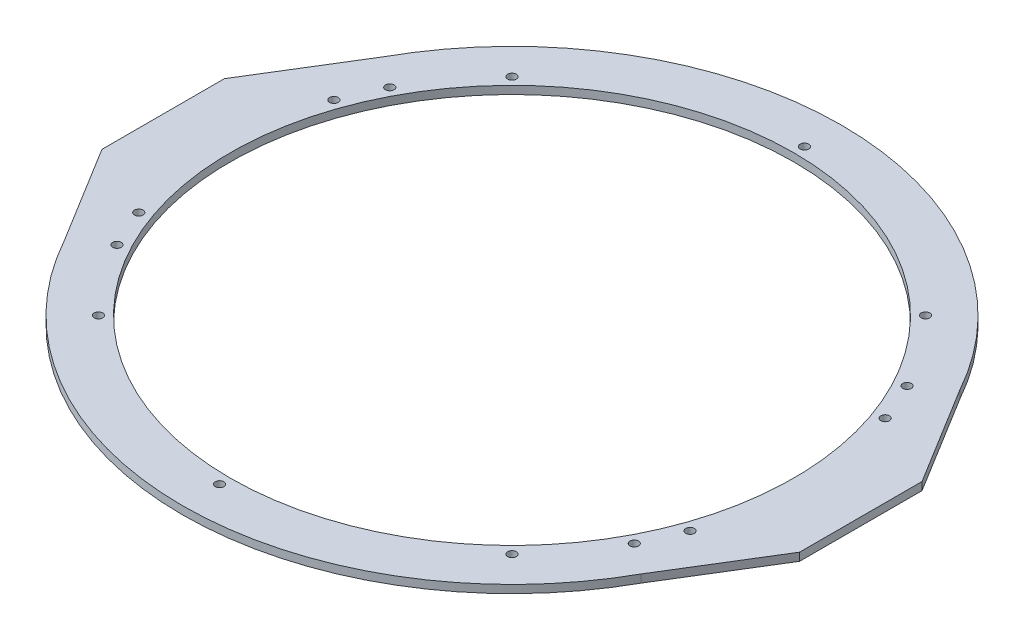
ISO-10303-21;
HEADER;
FILE_DESCRIPTION(('STEP AP214'),'2;1');
FILE_NAME('part.step','',(''),(''),'','','');
FILE_SCHEMA(('AUTOMOTIVE_DESIGN { 1 0 10303 214 1 1 1 1 }'));
ENDSEC;
DATA;
#1=APPLICATION_CONTEXT('core data for automotive mechanical design processes');
#2=APPLICATION_PROTOCOL_DEFINITION('international standard','automotive_design',2000,#1);
#3=PRODUCT_CONTEXT('',#1,'mechanical');
#4=PRODUCT('Part','Part','',(#3));
#5=PRODUCT_RELATED_PRODUCT_CATEGORY('part','',(#4));
#6=PRODUCT_DEFINITION_FORMATION('','',#4);
#7=PRODUCT_DEFINITION_CONTEXT('part definition',#1,'design');
#8=PRODUCT_DEFINITION('design','',#6,#7);
#9=PRODUCT_DEFINITION_SHAPE('','',#8);
#10=(LENGTH_UNIT() NAMED_UNIT(*) SI_UNIT(.MILLI.,.METRE.));
#11=(NAMED_UNIT(*) PLANE_ANGLE_UNIT() SI_UNIT($,.RADIAN.));
#12=(NAMED_UNIT(*) SI_UNIT($,.STERADIAN.) SOLID_ANGLE_UNIT());
#13=UNCERTAINTY_MEASURE_WITH_UNIT(LENGTH_MEASURE(1.E-05),#10,'distance_accuracy_value','');
#14=(GEOMETRIC_REPRESENTATION_CONTEXT(3) GLOBAL_UNCERTAINTY_ASSIGNED_CONTEXT((#13)) GLOBAL_UNIT_ASSIGNED_CONTEXT((#10,
#11,#12)) REPRESENTATION_CONTEXT('',''));
#15=CARTESIAN_POINT('',(0.,0.,0.));
#16=DIRECTION('',(0.,0.,1.));
#17=DIRECTION('',(1.,0.,0.));
#18=AXIS2_PLACEMENT_3D('',#15,#16,#17);
#19=CARTESIAN_POINT('',(0.,9.525,0.));
#20=DIRECTION('',(0.,1.,0.));
#21=DIRECTION('',(0.,0.,1.));
#22=AXIS2_PLACEMENT_3D('',#19,#20,#21);
#23=PLANE('',#22);
#24=DIRECTION('',(-0.523949451624135,0.,-0.851749359930941));
#25=VECTOR('',#24,1.);
#26=CARTESIAN_POINT('',(345.166052231368,9.52500000000001,-190.921970676538));
#27=LINE('',#26,#25);
#28=CARTESIAN_POINT('',(417.548677299358,9.52500000000001,-73.2544086995688));
#29=VERTEX_POINT('',#28);
#30=CARTESIAN_POINT('',(345.166052231368,9.52500000000001,-190.921970676538));
#31=VERTEX_POINT('',#30);
#32=EDGE_CURVE('E111',#29,#31,#27,.T.);
#33=ORIENTED_EDGE('',*,*,#32,.T.);
#34=CARTESIAN_POINT('',(0.,9.525,0.));
#35=DIRECTION('',(0.,1.,0.));
#36=DIRECTION('',(0.,0.,1.));
#37=AXIS2_PLACEMENT_3D('',#34,#35,#36);
#38=CIRCLE('',#37,394.45);
#39=CARTESIAN_POINT('',(-345.166052231368,9.52500000000001,-190.921970676538));
#40=VERTEX_POINT('',#39);
#41=EDGE_CURVE('E53',#31,#40,#38,.T.);
#42=ORIENTED_EDGE('',*,*,#41,.T.);
#43=DIRECTION('',(0.523949451624135,0.,-0.851749359930941));
#44=VECTOR('',#43,1.);
#45=CARTESIAN_POINT('',(-345.166052231368,9.52500000000001,-190.921970676538));
#46=LINE('',#45,#44);
#47=CARTESIAN_POINT('',(-417.548677299358,9.52500000000001,-73.2544086995688));
#48=VERTEX_POINT('',#47);
#49=EDGE_CURVE('E426',#48,#40,#46,.T.);
#50=ORIENTED_EDGE('',*,*,#49,.F.);
#51=DIRECTION('',(0.,0.,-1.));
#52=VECTOR('',#51,1.);
#53=CARTESIAN_POINT('',(-417.548677299358,9.52500000000001,-190.921970676538));
#54=LINE('',#53,#52);
#55=CARTESIAN_POINT('',(-417.548677299358,9.52500000000001,73.2544086995688));
#56=VERTEX_POINT('',#55);
#57=EDGE_CURVE('E414',#56,#48,#54,.T.);
#58=ORIENTED_EDGE('',*,*,#57,.F.);
#59=DIRECTION('',(0.523949451624135,0.,0.851749359930941));
#60=VECTOR('',#59,1.);
#61=CARTESIAN_POINT('',(-345.166052231368,9.52500000000001,190.921970676538));
#62=LINE('',#61,#60);
#63=CARTESIAN_POINT('',(-345.166052231368,9.52500000000001,190.921970676538));
#64=VERTEX_POINT('',#63);
#65=EDGE_CURVE('E412',#56,#64,#62,.T.);
#66=ORIENTED_EDGE('',*,*,#65,.T.);
#67=CARTESIAN_POINT('',(345.166052231368,9.52500000000001,190.921970676538));
#68=VERTEX_POINT('',#67);
#69=EDGE_CURVE('E13',#64,#68,#38,.T.);
#70=ORIENTED_EDGE('',*,*,#69,.T.);
#71=DIRECTION('',(-0.523949451624135,0.,0.851749359930941));
#72=VECTOR('',#71,1.);
#73=CARTESIAN_POINT('',(345.166052231368,9.52500000000001,190.921970676538));
#74=LINE('',#73,#72);
#75=CARTESIAN_POINT('',(417.548677299358,9.52500000000001,73.2544086995688));
#76=VERTEX_POINT('',#75);
#77=EDGE_CURVE('E134',#76,#68,#74,.T.);
#78=ORIENTED_EDGE('',*,*,#77,.F.);
#79=DIRECTION('',(0.,0.,-1.));
#80=VECTOR('',#79,1.);
#81=CARTESIAN_POINT('',(417.548677299358,9.52500000000001,-190.921970676538));
#82=LINE('',#81,#80);
#83=EDGE_CURVE('E128',#76,#29,#82,.T.);
#84=ORIENTED_EDGE('',*,*,#83,.T.);
#85=EDGE_LOOP('',(#33,#42,#50,#58,#66,#70,#78,#84));
#86=FACE_BOUND('',#85,.T.);
#87=CARTESIAN_POINT('',(0.,9.525,350.));
#88=DIRECTION('',(0.,1.,0.));
#89=DIRECTION('',(0.,0.,1.));
#90=AXIS2_PLACEMENT_3D('',#87,#88,#89);
#91=CIRCLE('',#90,5.15873999999999);
#92=CARTESIAN_POINT('',(0.,9.525,355.15874));
#93=VERTEX_POINT('',#92);
#94=EDGE_CURVE('E432',#93,#93,#91,.T.);
#95=ORIENTED_EDGE('',*,*,#94,.F.);
#96=EDGE_LOOP('',(#95));
#97=FACE_BOUND('',#96,.T.);
#98=CARTESIAN_POINT('',(-247.487373415292,9.525,247.487373415291));
#99=DIRECTION('',(0.,1.,0.));
#100=DIRECTION('',(0.,0.,1.));
#101=AXIS2_PLACEMENT_3D('',#98,#99,#100);
#102=CIRCLE('',#101,5.15873999999999);
#103=CARTESIAN_POINT('',(-247.487373415292,9.525,252.646113415291));
#104=VERTEX_POINT('',#103);
#105=EDGE_CURVE('E438',#104,#104,#102,.T.);
#106=ORIENTED_EDGE('',*,*,#105,.F.);
#107=EDGE_LOOP('',(#106));
#108=FACE_BOUND('',#107,.T.);
#109=CARTESIAN_POINT('',(-247.487373415289,9.525,-247.487373415295));
#110=DIRECTION('',(0.,1.,0.));
#111=DIRECTION('',(0.,0.,1.));
#112=AXIS2_PLACEMENT_3D('',#109,#110,#111);
#113=CIRCLE('',#112,5.15873999999999);
#114=CARTESIAN_POINT('',(-247.487373415289,9.525,-242.328633415295));
#115=VERTEX_POINT('',#114);
#116=EDGE_CURVE('E444',#115,#115,#113,.T.);
#117=ORIENTED_EDGE('',*,*,#116,.F.);
#118=EDGE_LOOP('',(#117));
#119=FACE_BOUND('',#118,.T.);
#120=CARTESIAN_POINT('',(2.41473507855972E-12,9.525,-350.));
#121=DIRECTION('',(0.,1.,0.));
#122=DIRECTION('',(0.,0.,1.));
#123=AXIS2_PLACEMENT_3D('',#120,#121,#122);
#124=CIRCLE('',#123,5.15873999999999);
#125=CARTESIAN_POINT('',(2.41473507855972E-12,9.525,-344.84126));
#126=VERTEX_POINT('',#125);
#127=EDGE_CURVE('E450',#126,#126,#124,.T.);
#128=ORIENTED_EDGE('',*,*,#127,.F.);
#129=EDGE_LOOP('',(#128));
#130=FACE_BOUND('',#129,.T.);
#131=CARTESIAN_POINT('',(247.487373415294,9.525,-247.48737341529));
#132=DIRECTION('',(0.,1.,0.));
#133=DIRECTION('',(0.,0.,1.));
#134=AXIS2_PLACEMENT_3D('',#131,#132,#133);
#135=CIRCLE('',#134,5.15873999999997);
#136=CARTESIAN_POINT('',(247.487373415294,9.525,-242.32863341529));
#137=VERTEX_POINT('',#136);
#138=EDGE_CURVE('E456',#137,#137,#135,.T.);
#139=ORIENTED_EDGE('',*,*,#138,.F.);
#140=EDGE_LOOP('',(#139));
#141=FACE_BOUND('',#140,.T.);
#142=CARTESIAN_POINT('',(247.487373415289,9.525,247.487373415295));
#143=DIRECTION('',(0.,1.,0.));
#144=DIRECTION('',(0.,0.,1.));
#145=AXIS2_PLACEMENT_3D('',#142,#143,#144);
#146=CIRCLE('',#145,5.15873999999999);
#147=CARTESIAN_POINT('',(247.487373415289,9.525,252.646113415295));
#148=VERTEX_POINT('',#147);
#149=EDGE_CURVE('E462',#148,#148,#146,.T.);
#150=ORIENTED_EDGE('',*,*,#149,.F.);
#151=EDGE_LOOP('',(#150));
#152=FACE_BOUND('',#151,.T.);
#153=CARTESIAN_POINT('',(329.955744274157,9.525,-116.744193947652));
#154=DIRECTION('',(0.,1.,0.));
#155=DIRECTION('',(0.,0.,1.));
#156=AXIS2_PLACEMENT_3D('',#153,#154,#155);
#157=CIRCLE('',#156,5.15873999999999);
#158=CARTESIAN_POINT('',(329.955744274157,9.525,-111.585453947652));
#159=VERTEX_POINT('',#158);
#160=EDGE_CURVE('E468',#159,#159,#157,.T.);
#161=ORIENTED_EDGE('',*,*,#160,.F.);
#162=EDGE_LOOP('',(#161));
#163=FACE_BOUND('',#162,.T.);
#164=CARTESIAN_POINT('',(309.580339669964,9.525,-163.278943191796));
#165=DIRECTION('',(0.,1.,0.));
#166=DIRECTION('',(0.,0.,1.));
#167=AXIS2_PLACEMENT_3D('',#164,#165,#166);
#168=CIRCLE('',#167,5.15873999999999);
#169=CARTESIAN_POINT('',(309.580339669964,9.525,-158.120203191796));
#170=VERTEX_POINT('',#169);
#171=EDGE_CURVE('E474',#170,#170,#168,.T.);
#172=ORIENTED_EDGE('',*,*,#171,.F.);
#173=EDGE_LOOP('',(#172));
#174=FACE_BOUND('',#173,.T.);
#175=CARTESIAN_POINT('',(-329.955744274157,9.525,-116.744193947652));
#176=DIRECTION('',(0.,1.,0.));
#177=DIRECTION('',(0.,0.,1.));
#178=AXIS2_PLACEMENT_3D('',#175,#176,#177);
#179=CIRCLE('',#178,5.15873999999999);
#180=CARTESIAN_POINT('',(-329.955744274157,9.525,-111.585453947652));
#181=VERTEX_POINT('',#180);
#182=EDGE_CURVE('E480',#181,#181,#179,.T.);
#183=ORIENTED_EDGE('',*,*,#182,.F.);
#184=EDGE_LOOP('',(#183));
#185=FACE_BOUND('',#184,.T.);
#186=CARTESIAN_POINT('',(-309.580339669964,9.525,-163.278943191796));
#187=DIRECTION('',(0.,1.,0.));
#188=DIRECTION('',(0.,0.,1.));
#189=AXIS2_PLACEMENT_3D('',#186,#187,#188);
#190=CIRCLE('',#189,5.15873999999999);
#191=CARTESIAN_POINT('',(-309.580339669964,9.525,-158.120203191796));
#192=VERTEX_POINT('',#191);
#193=EDGE_CURVE('E486',#192,#192,#190,.T.);
#194=ORIENTED_EDGE('',*,*,#193,.F.);
#195=EDGE_LOOP('',(#194));
#196=FACE_BOUND('',#195,.T.);
#197=CARTESIAN_POINT('',(-329.955744274157,9.525,116.744193947652));
#198=DIRECTION('',(0.,1.,0.));
#199=DIRECTION('',(0.,0.,1.));
#200=AXIS2_PLACEMENT_3D('',#197,#198,#199);
#201=CIRCLE('',#200,5.15873999999999);
#202=CARTESIAN_POINT('',(-329.955744274157,9.525,121.902933947652));
#203=VERTEX_POINT('',#202);
#204=EDGE_CURVE('E492',#203,#203,#201,.T.);
#205=ORIENTED_EDGE('',*,*,#204,.F.);
#206=EDGE_LOOP('',(#205));
#207=FACE_BOUND('',#206,.T.);
#208=CARTESIAN_POINT('',(-309.580339669964,9.525,163.278943191796));
#209=DIRECTION('',(0.,1.,0.));
#210=DIRECTION('',(0.,0.,1.));
#211=AXIS2_PLACEMENT_3D('',#208,#209,#210);
#212=CIRCLE('',#211,5.15873999999999);
#213=CARTESIAN_POINT('',(-309.580339669964,9.525,168.437683191796));
#214=VERTEX_POINT('',#213);
#215=EDGE_CURVE('E498',#214,#214,#212,.T.);
#216=ORIENTED_EDGE('',*,*,#215,.F.);
#217=EDGE_LOOP('',(#216));
#218=FACE_BOUND('',#217,.T.);
#219=CARTESIAN_POINT('',(329.955744274157,9.525,116.744193947652));
#220=DIRECTION('',(0.,1.,0.));
#221=DIRECTION('',(0.,0.,1.));
#222=AXIS2_PLACEMENT_3D('',#219,#220,#221);
#223=CIRCLE('',#222,5.15873999999999);
#224=CARTESIAN_POINT('',(329.955744274157,9.525,121.902933947652));
#225=VERTEX_POINT('',#224);
#226=EDGE_CURVE('E504',#225,#225,#223,.T.);
#227=ORIENTED_EDGE('',*,*,#226,.F.);
#228=EDGE_LOOP('',(#227));
#229=FACE_BOUND('',#228,.T.);
#230=CARTESIAN_POINT('',(309.580339669964,9.525,163.278943191796));
#231=DIRECTION('',(0.,1.,0.));
#232=DIRECTION('',(0.,0.,1.));
#233=AXIS2_PLACEMENT_3D('',#230,#231,#232);
#234=CIRCLE('',#233,5.15873999999999);
#235=CARTESIAN_POINT('',(309.580339669964,9.525,168.437683191796));
#236=VERTEX_POINT('',#235);
#237=EDGE_CURVE('E510',#236,#236,#234,.T.);
#238=ORIENTED_EDGE('',*,*,#237,.F.);
#239=EDGE_LOOP('',(#238));
#240=FACE_BOUND('',#239,.T.);
#241=CARTESIAN_POINT('',(0.,9.525,0.));
#242=DIRECTION('',(0.,1.,0.));
#243=DIRECTION('',(0.,0.,1.));
#244=AXIS2_PLACEMENT_3D('',#241,#242,#243);
#245=CIRCLE('',#244,337.3);
#246=CARTESIAN_POINT('',(0.,9.525,337.3));
#247=VERTEX_POINT('',#246);
#248=EDGE_CURVE('E144',#247,#247,#245,.T.);
#249=ORIENTED_EDGE('',*,*,#248,.F.);
#250=EDGE_LOOP('',(#249));
#251=FACE_BOUND('',#250,.T.);
#252=ADVANCED_FACE('F44',(#86,#97,#108,#119,#130,#141,#152,#163,#174,#185,#196,#207,#218,#229,
#240,#251),#23,.T.);
#253=CARTESIAN_POINT('',(0.,0.,0.));
#254=DIRECTION('',(0.,1.,0.));
#255=DIRECTION('',(0.,0.,1.));
#256=AXIS2_PLACEMENT_3D('',#253,#254,#255);
#257=PLANE('',#256);
#258=CARTESIAN_POINT('',(0.,0.,350.));
#259=DIRECTION('',(0.,1.,0.));
#260=DIRECTION('',(0.,0.,1.));
#261=AXIS2_PLACEMENT_3D('',#258,#259,#260);
#262=CIRCLE('',#261,5.15874);
#263=CARTESIAN_POINT('',(0.,0.,355.15874));
#264=VERTEX_POINT('',#263);
#265=EDGE_CURVE('E435',#264,#264,#262,.T.);
#266=ORIENTED_EDGE('',*,*,#265,.T.);
#267=EDGE_LOOP('',(#266));
#268=FACE_BOUND('',#267,.T.);
#269=CARTESIAN_POINT('',(-247.487373415292,0.,247.487373415291));
#270=DIRECTION('',(0.,1.,0.));
#271=DIRECTION('',(0.,0.,1.));
#272=AXIS2_PLACEMENT_3D('',#269,#270,#271);
#273=CIRCLE('',#272,5.15873999999999);
#274=CARTESIAN_POINT('',(-247.487373415292,0.,252.646113415291));
#275=VERTEX_POINT('',#274);
#276=EDGE_CURVE('E441',#275,#275,#273,.T.);
#277=ORIENTED_EDGE('',*,*,#276,.T.);
#278=EDGE_LOOP('',(#277));
#279=FACE_BOUND('',#278,.T.);
#280=CARTESIAN_POINT('',(-247.487373415289,0.,-247.487373415295));
#281=DIRECTION('',(0.,1.,0.));
#282=DIRECTION('',(0.,0.,1.));
#283=AXIS2_PLACEMENT_3D('',#280,#281,#282);
#284=CIRCLE('',#283,5.15873999999999);
#285=CARTESIAN_POINT('',(-247.487373415289,0.,-242.328633415295));
#286=VERTEX_POINT('',#285);
#287=EDGE_CURVE('E447',#286,#286,#284,.T.);
#288=ORIENTED_EDGE('',*,*,#287,.T.);
#289=EDGE_LOOP('',(#288));
#290=FACE_BOUND('',#289,.T.);
#291=CARTESIAN_POINT('',(2.41473507855972E-12,0.,-350.));
#292=DIRECTION('',(0.,1.,0.));
#293=DIRECTION('',(0.,0.,1.));
#294=AXIS2_PLACEMENT_3D('',#291,#292,#293);
#295=CIRCLE('',#294,5.15874);
#296=CARTESIAN_POINT('',(2.41473507855972E-12,0.,-344.84126));
#297=VERTEX_POINT('',#296);
#298=EDGE_CURVE('E453',#297,#297,#295,.T.);
#299=ORIENTED_EDGE('',*,*,#298,.T.);
#300=EDGE_LOOP('',(#299));
#301=FACE_BOUND('',#300,.T.);
#302=CARTESIAN_POINT('',(247.487373415294,0.,-247.48737341529));
#303=DIRECTION('',(0.,1.,0.));
#304=DIRECTION('',(0.,0.,1.));
#305=AXIS2_PLACEMENT_3D('',#302,#303,#304);
#306=CIRCLE('',#305,5.15874000000002);
#307=CARTESIAN_POINT('',(247.487373415294,0.,-242.328633415289));
#308=VERTEX_POINT('',#307);
#309=EDGE_CURVE('E459',#308,#308,#306,.T.);
#310=ORIENTED_EDGE('',*,*,#309,.T.);
#311=EDGE_LOOP('',(#310));
#312=FACE_BOUND('',#311,.T.);
#313=CARTESIAN_POINT('',(247.487373415289,0.,247.487373415295));
#314=DIRECTION('',(0.,1.,0.));
#315=DIRECTION('',(0.,0.,1.));
#316=AXIS2_PLACEMENT_3D('',#313,#314,#315);
#317=CIRCLE('',#316,5.15873999999999);
#318=CARTESIAN_POINT('',(247.487373415289,0.,252.646113415295));
#319=VERTEX_POINT('',#318);
#320=EDGE_CURVE('E465',#319,#319,#317,.T.);
#321=ORIENTED_EDGE('',*,*,#320,.T.);
#322=EDGE_LOOP('',(#321));
#323=FACE_BOUND('',#322,.T.);
#324=CARTESIAN_POINT('',(329.955744274157,0.,-116.744193947652));
#325=DIRECTION('',(0.,1.,0.));
#326=DIRECTION('',(0.,0.,1.));
#327=AXIS2_PLACEMENT_3D('',#324,#325,#326);
#328=CIRCLE('',#327,5.15873999999999);
#329=CARTESIAN_POINT('',(329.955744274157,0.,-111.585453947652));
#330=VERTEX_POINT('',#329);
#331=EDGE_CURVE('E471',#330,#330,#328,.T.);
#332=ORIENTED_EDGE('',*,*,#331,.T.);
#333=EDGE_LOOP('',(#332));
#334=FACE_BOUND('',#333,.T.);
#335=CARTESIAN_POINT('',(309.580339669964,0.,-163.278943191796));
#336=DIRECTION('',(0.,1.,0.));
#337=DIRECTION('',(0.,0.,1.));
#338=AXIS2_PLACEMENT_3D('',#335,#336,#337);
#339=CIRCLE('',#338,5.15873999999999);
#340=CARTESIAN_POINT('',(309.580339669964,0.,-158.120203191796));
#341=VERTEX_POINT('',#340);
#342=EDGE_CURVE('E477',#341,#341,#339,.T.);
#343=ORIENTED_EDGE('',*,*,#342,.T.);
#344=EDGE_LOOP('',(#343));
#345=FACE_BOUND('',#344,.T.);
#346=CARTESIAN_POINT('',(-329.955744274157,0.,-116.744193947652));
#347=DIRECTION('',(0.,1.,0.));
#348=DIRECTION('',(0.,0.,1.));
#349=AXIS2_PLACEMENT_3D('',#346,#347,#348);
#350=CIRCLE('',#349,5.15873999999999);
#351=CARTESIAN_POINT('',(-329.955744274157,0.,-111.585453947652));
#352=VERTEX_POINT('',#351);
#353=EDGE_CURVE('E483',#352,#352,#350,.T.);
#354=ORIENTED_EDGE('',*,*,#353,.T.);
#355=EDGE_LOOP('',(#354));
#356=FACE_BOUND('',#355,.T.);
#357=CARTESIAN_POINT('',(-309.580339669964,0.,-163.278943191796));
#358=DIRECTION('',(0.,1.,0.));
#359=DIRECTION('',(0.,0.,1.));
#360=AXIS2_PLACEMENT_3D('',#357,#358,#359);
#361=CIRCLE('',#360,5.15873999999999);
#362=CARTESIAN_POINT('',(-309.580339669964,0.,-158.120203191796));
#363=VERTEX_POINT('',#362);
#364=EDGE_CURVE('E489',#363,#363,#361,.T.);
#365=ORIENTED_EDGE('',*,*,#364,.T.);
#366=EDGE_LOOP('',(#365));
#367=FACE_BOUND('',#366,.T.);
#368=CARTESIAN_POINT('',(-329.955744274157,0.,116.744193947652));
#369=DIRECTION('',(0.,1.,0.));
#370=DIRECTION('',(0.,0.,1.));
#371=AXIS2_PLACEMENT_3D('',#368,#369,#370);
#372=CIRCLE('',#371,5.15873999999999);
#373=CARTESIAN_POINT('',(-329.955744274157,0.,121.902933947652));
#374=VERTEX_POINT('',#373);
#375=EDGE_CURVE('E495',#374,#374,#372,.T.);
#376=ORIENTED_EDGE('',*,*,#375,.T.);
#377=EDGE_LOOP('',(#376));
#378=FACE_BOUND('',#377,.T.);
#379=CARTESIAN_POINT('',(-309.580339669964,0.,163.278943191796));
#380=DIRECTION('',(0.,1.,0.));
#381=DIRECTION('',(0.,0.,1.));
#382=AXIS2_PLACEMENT_3D('',#379,#380,#381);
#383=CIRCLE('',#382,5.15873999999999);
#384=CARTESIAN_POINT('',(-309.580339669964,0.,168.437683191796));
#385=VERTEX_POINT('',#384);
#386=EDGE_CURVE('E501',#385,#385,#383,.T.);
#387=ORIENTED_EDGE('',*,*,#386,.T.);
#388=EDGE_LOOP('',(#387));
#389=FACE_BOUND('',#388,.T.);
#390=CARTESIAN_POINT('',(329.955744274157,0.,116.744193947652));
#391=DIRECTION('',(0.,1.,0.));
#392=DIRECTION('',(0.,0.,1.));
#393=AXIS2_PLACEMENT_3D('',#390,#391,#392);
#394=CIRCLE('',#393,5.15873999999999);
#395=CARTESIAN_POINT('',(329.955744274157,0.,121.902933947652));
#396=VERTEX_POINT('',#395);
#397=EDGE_CURVE('E507',#396,#396,#394,.T.);
#398=ORIENTED_EDGE('',*,*,#397,.T.);
#399=EDGE_LOOP('',(#398));
#400=FACE_BOUND('',#399,.T.);
#401=CARTESIAN_POINT('',(309.580339669964,0.,163.278943191796));
#402=DIRECTION('',(0.,1.,0.));
#403=DIRECTION('',(0.,0.,1.));
#404=AXIS2_PLACEMENT_3D('',#401,#402,#403);
#405=CIRCLE('',#404,5.15873999999999);
#406=CARTESIAN_POINT('',(309.580339669964,0.,168.437683191796));
#407=VERTEX_POINT('',#406);
#408=EDGE_CURVE('E513',#407,#407,#405,.T.);
#409=ORIENTED_EDGE('',*,*,#408,.T.);
#410=EDGE_LOOP('',(#409));
#411=FACE_BOUND('',#410,.T.);
#412=CARTESIAN_POINT('',(0.,0.,0.));
#413=DIRECTION('',(0.,1.,0.));
#414=DIRECTION('',(0.,0.,1.));
#415=AXIS2_PLACEMENT_3D('',#412,#413,#414);
#416=CIRCLE('',#415,337.3);
#417=CARTESIAN_POINT('',(0.,0.,337.3));
#418=VERTEX_POINT('',#417);
#419=EDGE_CURVE('E143',#418,#418,#416,.T.);
#420=ORIENTED_EDGE('',*,*,#419,.T.);
#421=EDGE_LOOP('',(#420));
#422=FACE_BOUND('',#421,.T.);
#423=CARTESIAN_POINT('',(0.,0.,0.));
#424=DIRECTION('',(0.,1.,0.));
#425=DIRECTION('',(0.,0.,1.));
#426=AXIS2_PLACEMENT_3D('',#423,#424,#425);
#427=CIRCLE('',#426,394.45);
#428=CARTESIAN_POINT('',(345.166052231368,0.,-190.921970676538));
#429=VERTEX_POINT('',#428);
#430=CARTESIAN_POINT('',(-345.166052231368,0.,-190.921970676538));
#431=VERTEX_POINT('',#430);
#432=EDGE_CURVE('E147',#429,#431,#427,.T.);
#433=ORIENTED_EDGE('',*,*,#432,.F.);
#434=DIRECTION('',(-0.523949451624135,0.,-0.851749359930941));
#435=VECTOR('',#434,1.);
#436=CARTESIAN_POINT('',(345.166052231368,0.,-190.921970676538));
#437=LINE('',#436,#435);
#438=CARTESIAN_POINT('',(417.548677299358,0.,-73.2544086995688));
#439=VERTEX_POINT('',#438);
#440=EDGE_CURVE('E122',#439,#429,#437,.T.);
#441=ORIENTED_EDGE('',*,*,#440,.F.);
#442=DIRECTION('',(0.,0.,-1.));
#443=VECTOR('',#442,1.);
#444=CARTESIAN_POINT('',(417.548677299358,0.,-190.921970676538));
#445=LINE('',#444,#443);
#446=CARTESIAN_POINT('',(417.548677299358,0.,73.2544086995688));
#447=VERTEX_POINT('',#446);
#448=EDGE_CURVE('E130',#447,#439,#445,.T.);
#449=ORIENTED_EDGE('',*,*,#448,.F.);
#450=DIRECTION('',(-0.523949451624135,0.,0.851749359930941));
#451=VECTOR('',#450,1.);
#452=CARTESIAN_POINT('',(345.166052231368,0.,190.921970676538));
#453=LINE('',#452,#451);
#454=CARTESIAN_POINT('',(345.166052231368,0.,190.921970676538));
#455=VERTEX_POINT('',#454);
#456=EDGE_CURVE('E60',#447,#455,#453,.T.);
#457=ORIENTED_EDGE('',*,*,#456,.T.);
#458=CARTESIAN_POINT('',(-345.166052231368,0.,190.921970676538));
#459=VERTEX_POINT('',#458);
#460=EDGE_CURVE('E48',#459,#455,#427,.T.);
#461=ORIENTED_EDGE('',*,*,#460,.F.);
#462=DIRECTION('',(0.523949451624135,0.,0.851749359930941));
#463=VECTOR('',#462,1.);
#464=CARTESIAN_POINT('',(-345.166052231368,0.,190.921970676538));
#465=LINE('',#464,#463);
#466=CARTESIAN_POINT('',(-417.548677299358,0.,73.2544086995688));
#467=VERTEX_POINT('',#466);
#468=EDGE_CURVE('E417',#467,#459,#465,.T.);
#469=ORIENTED_EDGE('',*,*,#468,.F.);
#470=DIRECTION('',(0.,0.,-1.));
#471=VECTOR('',#470,1.);
#472=CARTESIAN_POINT('',(-417.548677299358,0.,-190.921970676538));
#473=LINE('',#472,#471);
#474=CARTESIAN_POINT('',(-417.548677299358,0.,-73.2544086995688));
#475=VERTEX_POINT('',#474);
#476=EDGE_CURVE('E68',#467,#475,#473,.T.);
#477=ORIENTED_EDGE('',*,*,#476,.T.);
#478=DIRECTION('',(0.523949451624135,0.,-0.851749359930941));
#479=VECTOR('',#478,1.);
#480=CARTESIAN_POINT('',(-345.166052231368,0.,-190.921970676538));
#481=LINE('',#480,#479);
#482=EDGE_CURVE('E419',#475,#431,#481,.T.);
#483=ORIENTED_EDGE('',*,*,#482,.T.);
#484=EDGE_LOOP('',(#433,#441,#449,#457,#461,#469,#477,#483));
#485=FACE_BOUND('',#484,.T.);
#486=ADVANCED_FACE('F151',(#268,#279,#290,#301,#312,#323,#334,#345,#356,#367,#378,#389,#400,
#411,#422,#485),#257,.F.);
#487=CARTESIAN_POINT('',(417.548677299358,416.047469764219,-190.921970676538));
#488=DIRECTION('',(-1.,0.,0.));
#489=DIRECTION('',(0.,0.,1.));
#490=AXIS2_PLACEMENT_3D('',#487,#488,#489);
#491=PLANE('',#490);
#492=ORIENTED_EDGE('',*,*,#448,.T.);
#493=DIRECTION('',(0.,-1.,0.));
#494=VECTOR('',#493,1.);
#495=CARTESIAN_POINT('',(417.548677299358,9.52500000000001,-73.2544086995688));
#496=LINE('',#495,#494);
#497=EDGE_CURVE('E114',#29,#439,#496,.T.);
#498=ORIENTED_EDGE('',*,*,#497,.F.);
#499=ORIENTED_EDGE('',*,*,#83,.F.);
#500=DIRECTION('',(0.,-1.,0.));
#501=VECTOR('',#500,1.);
#502=CARTESIAN_POINT('',(417.548677299358,9.52500000000001,73.2544086995688));
#503=LINE('',#502,#501);
#504=EDGE_CURVE('E421',#76,#447,#503,.T.);
#505=ORIENTED_EDGE('',*,*,#504,.T.);
#506=EDGE_LOOP('',(#492,#498,#499,#505));
#507=FACE_BOUND('',#506,.T.);
#508=ADVANCED_FACE('F127',(#507),#491,.F.);
#509=CARTESIAN_POINT('',(-417.548677299358,416.047469764219,-190.921970676538));
#510=DIRECTION('',(-1.,0.,0.));
#511=DIRECTION('',(0.,0.,1.));
#512=AXIS2_PLACEMENT_3D('',#509,#510,#511);
#513=PLANE('',#512);
#514=DIRECTION('',(0.,-1.,0.));
#515=VECTOR('',#514,1.);
#516=CARTESIAN_POINT('',(-417.548677299358,9.52500000000001,73.2544086995688));
#517=LINE('',#516,#515);
#518=EDGE_CURVE('E416',#56,#467,#517,.T.);
#519=ORIENTED_EDGE('',*,*,#518,.F.);
#520=ORIENTED_EDGE('',*,*,#57,.T.);
#521=DIRECTION('',(0.,-1.,0.));
#522=VECTOR('',#521,1.);
#523=CARTESIAN_POINT('',(-417.548677299358,9.52500000000001,-73.2544086995688));
#524=LINE('',#523,#522);
#525=EDGE_CURVE('E428',#48,#475,#524,.T.);
#526=ORIENTED_EDGE('',*,*,#525,.T.);
#527=ORIENTED_EDGE('',*,*,#476,.F.);
#528=EDGE_LOOP('',(#519,#520,#526,#527));
#529=FACE_BOUND('',#528,.T.);
#530=ADVANCED_FACE('F170',(#529),#513,.T.);
#531=CARTESIAN_POINT('',(0.,9.525,0.));
#532=DIRECTION('',(0.,-1.,0.));
#533=DIRECTION('',(0.,0.,-1.));
#534=AXIS2_PLACEMENT_3D('',#531,#532,#533);
#535=CYLINDRICAL_SURFACE('',#534,394.45);
#536=ORIENTED_EDGE('',*,*,#69,.F.);
#537=DIRECTION('',(0.,-1.,0.));
#538=VECTOR('',#537,1.);
#539=CARTESIAN_POINT('',(-345.166052231368,9.525,190.921970676538));
#540=LINE('',#539,#538);
#541=EDGE_CURVE('E138',#64,#459,#540,.T.);
#542=ORIENTED_EDGE('',*,*,#541,.T.);
#543=ORIENTED_EDGE('',*,*,#460,.T.);
#544=DIRECTION('',(0.,-1.,0.));
#545=VECTOR('',#544,1.);
#546=CARTESIAN_POINT('',(345.166052231368,9.525,190.921970676538));
#547=LINE('',#546,#545);
#548=EDGE_CURVE('E136',#68,#455,#547,.T.);
#549=ORIENTED_EDGE('',*,*,#548,.F.);
#550=EDGE_LOOP('',(#536,#542,#543,#549));
#551=FACE_BOUND('',#550,.T.);
#552=ADVANCED_FACE('F46',(#551),#535,.T.);
#553=ORIENTED_EDGE('',*,*,#432,.T.);
#554=DIRECTION('',(0.,-1.,0.));
#555=VECTOR('',#554,1.);
#556=CARTESIAN_POINT('',(-345.166052231368,9.525,-190.921970676538));
#557=LINE('',#556,#555);
#558=EDGE_CURVE('E518',#431,#40,#557,.F.);
#559=ORIENTED_EDGE('',*,*,#558,.T.);
#560=ORIENTED_EDGE('',*,*,#41,.F.);
#561=DIRECTION('',(0.,-1.,0.));
#562=VECTOR('',#561,1.);
#563=CARTESIAN_POINT('',(345.166052231368,9.525,-190.921970676538));
#564=LINE('',#563,#562);
#565=EDGE_CURVE('E117',#429,#31,#564,.F.);
#566=ORIENTED_EDGE('',*,*,#565,.F.);
#567=EDGE_LOOP('',(#553,#559,#560,#566));
#568=FACE_BOUND('',#567,.T.);
#569=ADVANCED_FACE('F157',(#568),#535,.T.);
#570=CARTESIAN_POINT('',(0.,9.525,0.));
#571=DIRECTION('',(0.,-1.,0.));
#572=DIRECTION('',(0.,0.,-1.));
#573=AXIS2_PLACEMENT_3D('',#570,#571,#572);
#574=CYLINDRICAL_SURFACE('',#573,337.3);
#575=ORIENTED_EDGE('',*,*,#419,.F.);
#576=EDGE_LOOP('',(#575));
#577=FACE_BOUND('',#576,.T.);
#578=ORIENTED_EDGE('',*,*,#248,.T.);
#579=EDGE_LOOP('',(#578));
#580=FACE_BOUND('',#579,.T.);
#581=ADVANCED_FACE('F153',(#577,#580),#574,.F.);
#582=CARTESIAN_POINT('',(309.580339669964,9.525,163.278943191796));
#583=DIRECTION('',(0.,1.,0.));
#584=DIRECTION('',(0.,0.,1.));
#585=AXIS2_PLACEMENT_3D('',#582,#583,#584);
#586=CYLINDRICAL_SURFACE('',#585,5.15873999999999);
#587=ORIENTED_EDGE('',*,*,#408,.F.);
#588=EDGE_LOOP('',(#587));
#589=FACE_BOUND('',#588,.T.);
#590=ORIENTED_EDGE('',*,*,#237,.T.);
#591=EDGE_LOOP('',(#590));
#592=FACE_BOUND('',#591,.T.);
#593=ADVANCED_FACE('F156',(#589,#592),#586,.F.);
#594=CARTESIAN_POINT('',(329.955744274157,9.525,116.744193947652));
#595=DIRECTION('',(0.,1.,0.));
#596=DIRECTION('',(0.,0.,1.));
#597=AXIS2_PLACEMENT_3D('',#594,#595,#596);
#598=CYLINDRICAL_SURFACE('',#597,5.15873999999999);
#599=ORIENTED_EDGE('',*,*,#397,.F.);
#600=EDGE_LOOP('',(#599));
#601=FACE_BOUND('',#600,.T.);
#602=ORIENTED_EDGE('',*,*,#226,.T.);
#603=EDGE_LOOP('',(#602));
#604=FACE_BOUND('',#603,.T.);
#605=ADVANCED_FACE('F176',(#601,#604),#598,.F.);
#606=CARTESIAN_POINT('',(-309.580339669964,9.525,163.278943191796));
#607=DIRECTION('',(0.,1.,0.));
#608=DIRECTION('',(0.,0.,1.));
#609=AXIS2_PLACEMENT_3D('',#606,#607,#608);
#610=CYLINDRICAL_SURFACE('',#609,5.15873999999999);
#611=ORIENTED_EDGE('',*,*,#386,.F.);
#612=EDGE_LOOP('',(#611));
#613=FACE_BOUND('',#612,.T.);
#614=ORIENTED_EDGE('',*,*,#215,.T.);
#615=EDGE_LOOP('',(#614));
#616=FACE_BOUND('',#615,.T.);
#617=ADVANCED_FACE('F180',(#613,#616),#610,.F.);
#618=CARTESIAN_POINT('',(-329.955744274157,9.525,116.744193947652));
#619=DIRECTION('',(0.,1.,0.));
#620=DIRECTION('',(0.,0.,1.));
#621=AXIS2_PLACEMENT_3D('',#618,#619,#620);
#622=CYLINDRICAL_SURFACE('',#621,5.15873999999999);
#623=ORIENTED_EDGE('',*,*,#375,.F.);
#624=EDGE_LOOP('',(#623));
#625=FACE_BOUND('',#624,.T.);
#626=ORIENTED_EDGE('',*,*,#204,.T.);
#627=EDGE_LOOP('',(#626));
#628=FACE_BOUND('',#627,.T.);
#629=ADVANCED_FACE('F184',(#625,#628),#622,.F.);
#630=CARTESIAN_POINT('',(-309.580339669964,9.525,-163.278943191796));
#631=DIRECTION('',(0.,1.,0.));
#632=DIRECTION('',(0.,0.,1.));
#633=AXIS2_PLACEMENT_3D('',#630,#631,#632);
#634=CYLINDRICAL_SURFACE('',#633,5.15873999999999);
#635=ORIENTED_EDGE('',*,*,#364,.F.);
#636=EDGE_LOOP('',(#635));
#637=FACE_BOUND('',#636,.T.);
#638=ORIENTED_EDGE('',*,*,#193,.T.);
#639=EDGE_LOOP('',(#638));
#640=FACE_BOUND('',#639,.T.);
#641=ADVANCED_FACE('F188',(#637,#640),#634,.F.);
#642=CARTESIAN_POINT('',(-329.955744274157,9.525,-116.744193947652));
#643=DIRECTION('',(0.,1.,0.));
#644=DIRECTION('',(0.,0.,1.));
#645=AXIS2_PLACEMENT_3D('',#642,#643,#644);
#646=CYLINDRICAL_SURFACE('',#645,5.15873999999999);
#647=ORIENTED_EDGE('',*,*,#353,.F.);
#648=EDGE_LOOP('',(#647));
#649=FACE_BOUND('',#648,.T.);
#650=ORIENTED_EDGE('',*,*,#182,.T.);
#651=EDGE_LOOP('',(#650));
#652=FACE_BOUND('',#651,.T.);
#653=ADVANCED_FACE('F192',(#649,#652),#646,.F.);
#654=CARTESIAN_POINT('',(309.580339669964,9.525,-163.278943191796));
#655=DIRECTION('',(0.,1.,0.));
#656=DIRECTION('',(0.,0.,1.));
#657=AXIS2_PLACEMENT_3D('',#654,#655,#656);
#658=CYLINDRICAL_SURFACE('',#657,5.15873999999999);
#659=ORIENTED_EDGE('',*,*,#342,.F.);
#660=EDGE_LOOP('',(#659));
#661=FACE_BOUND('',#660,.T.);
#662=ORIENTED_EDGE('',*,*,#171,.T.);
#663=EDGE_LOOP('',(#662));
#664=FACE_BOUND('',#663,.T.);
#665=ADVANCED_FACE('F196',(#661,#664),#658,.F.);
#666=CARTESIAN_POINT('',(329.955744274157,9.525,-116.744193947652));
#667=DIRECTION('',(0.,1.,0.));
#668=DIRECTION('',(0.,0.,1.));
#669=AXIS2_PLACEMENT_3D('',#666,#667,#668);
#670=CYLINDRICAL_SURFACE('',#669,5.15873999999999);
#671=ORIENTED_EDGE('',*,*,#331,.F.);
#672=EDGE_LOOP('',(#671));
#673=FACE_BOUND('',#672,.T.);
#674=ORIENTED_EDGE('',*,*,#160,.T.);
#675=EDGE_LOOP('',(#674));
#676=FACE_BOUND('',#675,.T.);
#677=ADVANCED_FACE('F200',(#673,#676),#670,.F.);
#678=CARTESIAN_POINT('',(247.487373415289,9.525,247.487373415295));
#679=DIRECTION('',(0.,1.,0.));
#680=DIRECTION('',(0.,0.,1.));
#681=AXIS2_PLACEMENT_3D('',#678,#679,#680);
#682=CYLINDRICAL_SURFACE('',#681,5.15873999999999);
#683=ORIENTED_EDGE('',*,*,#320,.F.);
#684=EDGE_LOOP('',(#683));
#685=FACE_BOUND('',#684,.T.);
#686=ORIENTED_EDGE('',*,*,#149,.T.);
#687=EDGE_LOOP('',(#686));
#688=FACE_BOUND('',#687,.T.);
#689=ADVANCED_FACE('F204',(#685,#688),#682,.F.);
#690=CARTESIAN_POINT('',(247.487373415294,9.525,-247.48737341529));
#691=DIRECTION('',(0.,1.,0.));
#692=DIRECTION('',(0.,0.,1.));
#693=AXIS2_PLACEMENT_3D('',#690,#691,#692);
#694=CYLINDRICAL_SURFACE('',#693,5.15873999999999);
#695=ORIENTED_EDGE('',*,*,#309,.F.);
#696=EDGE_LOOP('',(#695));
#697=FACE_BOUND('',#696,.T.);
#698=ORIENTED_EDGE('',*,*,#138,.T.);
#699=EDGE_LOOP('',(#698));
#700=FACE_BOUND('',#699,.T.);
#701=ADVANCED_FACE('F208',(#697,#700),#694,.F.);
#702=CARTESIAN_POINT('',(2.41473507855972E-12,9.525,-350.));
#703=DIRECTION('',(0.,1.,0.));
#704=DIRECTION('',(0.,0.,1.));
#705=AXIS2_PLACEMENT_3D('',#702,#703,#704);
#706=CYLINDRICAL_SURFACE('',#705,5.15873999999999);
#707=ORIENTED_EDGE('',*,*,#298,.F.);
#708=EDGE_LOOP('',(#707));
#709=FACE_BOUND('',#708,.T.);
#710=ORIENTED_EDGE('',*,*,#127,.T.);
#711=EDGE_LOOP('',(#710));
#712=FACE_BOUND('',#711,.T.);
#713=ADVANCED_FACE('F212',(#709,#712),#706,.F.);
#714=CARTESIAN_POINT('',(-247.487373415289,9.525,-247.487373415295));
#715=DIRECTION('',(0.,1.,0.));
#716=DIRECTION('',(0.,0.,1.));
#717=AXIS2_PLACEMENT_3D('',#714,#715,#716);
#718=CYLINDRICAL_SURFACE('',#717,5.15873999999999);
#719=ORIENTED_EDGE('',*,*,#287,.F.);
#720=EDGE_LOOP('',(#719));
#721=FACE_BOUND('',#720,.T.);
#722=ORIENTED_EDGE('',*,*,#116,.T.);
#723=EDGE_LOOP('',(#722));
#724=FACE_BOUND('',#723,.T.);
#725=ADVANCED_FACE('F216',(#721,#724),#718,.F.);
#726=CARTESIAN_POINT('',(-247.487373415292,9.525,247.487373415291));
#727=DIRECTION('',(0.,1.,0.));
#728=DIRECTION('',(0.,0.,1.));
#729=AXIS2_PLACEMENT_3D('',#726,#727,#728);
#730=CYLINDRICAL_SURFACE('',#729,5.15873999999999);
#731=ORIENTED_EDGE('',*,*,#276,.F.);
#732=EDGE_LOOP('',(#731));
#733=FACE_BOUND('',#732,.T.);
#734=ORIENTED_EDGE('',*,*,#105,.T.);
#735=EDGE_LOOP('',(#734));
#736=FACE_BOUND('',#735,.T.);
#737=ADVANCED_FACE('F220',(#733,#736),#730,.F.);
#738=CARTESIAN_POINT('',(0.,9.525,350.));
#739=DIRECTION('',(0.,1.,0.));
#740=DIRECTION('',(0.,0.,1.));
#741=AXIS2_PLACEMENT_3D('',#738,#739,#740);
#742=CYLINDRICAL_SURFACE('',#741,5.15873999999999);
#743=ORIENTED_EDGE('',*,*,#265,.F.);
#744=EDGE_LOOP('',(#743));
#745=FACE_BOUND('',#744,.T.);
#746=ORIENTED_EDGE('',*,*,#94,.T.);
#747=EDGE_LOOP('',(#746));
#748=FACE_BOUND('',#747,.T.);
#749=ADVANCED_FACE('F224',(#745,#748),#742,.F.);
#750=CARTESIAN_POINT('',(-345.166052231368,9.52500000000001,-190.921970676538));
#751=DIRECTION('',(-0.851749359930941,0.,-0.523949451624135));
#752=DIRECTION('',(-0.523949451624135,0.,0.851749359930941));
#753=AXIS2_PLACEMENT_3D('',#750,#751,#752);
#754=PLANE('',#753);
#755=ORIENTED_EDGE('',*,*,#482,.F.);
#756=ORIENTED_EDGE('',*,*,#525,.F.);
#757=ORIENTED_EDGE('',*,*,#49,.T.);
#758=ORIENTED_EDGE('',*,*,#558,.F.);
#759=EDGE_LOOP('',(#755,#756,#757,#758));
#760=FACE_BOUND('',#759,.T.);
#761=ADVANCED_FACE('F228',(#760),#754,.T.);
#762=CARTESIAN_POINT('',(-345.166052231368,9.52500000000001,190.921970676538));
#763=DIRECTION('',(0.851749359930941,0.,-0.523949451624135));
#764=DIRECTION('',(-0.523949451624135,0.,-0.851749359930941));
#765=AXIS2_PLACEMENT_3D('',#762,#763,#764);
#766=PLANE('',#765);
#767=ORIENTED_EDGE('',*,*,#468,.T.);
#768=ORIENTED_EDGE('',*,*,#541,.F.);
#769=ORIENTED_EDGE('',*,*,#65,.F.);
#770=ORIENTED_EDGE('',*,*,#518,.T.);
#771=EDGE_LOOP('',(#767,#768,#769,#770));
#772=FACE_BOUND('',#771,.T.);
#773=ADVANCED_FACE('F232',(#772),#766,.F.);
#774=CARTESIAN_POINT('',(345.166052231368,9.52500000000001,190.921970676538));
#775=DIRECTION('',(0.851749359930941,0.,0.523949451624135));
#776=DIRECTION('',(0.523949451624135,0.,-0.851749359930941));
#777=AXIS2_PLACEMENT_3D('',#774,#775,#776);
#778=PLANE('',#777);
#779=ORIENTED_EDGE('',*,*,#456,.F.);
#780=ORIENTED_EDGE('',*,*,#504,.F.);
#781=ORIENTED_EDGE('',*,*,#77,.T.);
#782=ORIENTED_EDGE('',*,*,#548,.T.);
#783=EDGE_LOOP('',(#779,#780,#781,#782));
#784=FACE_BOUND('',#783,.T.);
#785=ADVANCED_FACE('F236',(#784),#778,.T.);
#786=CARTESIAN_POINT('',(345.166052231368,9.52500000000001,-190.921970676538));
#787=DIRECTION('',(-0.851749359930941,0.,0.523949451624135));
#788=DIRECTION('',(0.523949451624135,0.,0.851749359930941));
#789=AXIS2_PLACEMENT_3D('',#786,#787,#788);
#790=PLANE('',#789);
#791=ORIENTED_EDGE('',*,*,#440,.T.);
#792=ORIENTED_EDGE('',*,*,#565,.T.);
#793=ORIENTED_EDGE('',*,*,#32,.F.);
#794=ORIENTED_EDGE('',*,*,#497,.T.);
#795=EDGE_LOOP('',(#791,#792,#793,#794));
#796=FACE_BOUND('',#795,.T.);
#797=ADVANCED_FACE('F113',(#796),#790,.F.);
#798=CLOSED_SHELL('',(#252,#486,#508,#530,#552,#569,#581,#593,#605,#617,#629,#641,#653,#665,
#677,#689,#701,#713,#725,#737,#749,#761,#773,#785,#797));
#799=MANIFOLD_SOLID_BREP('B2',#798);
#800=ADVANCED_BREP_SHAPE_REPRESENTATION('',(#18,#799),#14);
#801=SHAPE_DEFINITION_REPRESENTATION(#9,#800);
ENDSEC;
END-ISO-10303-21;
